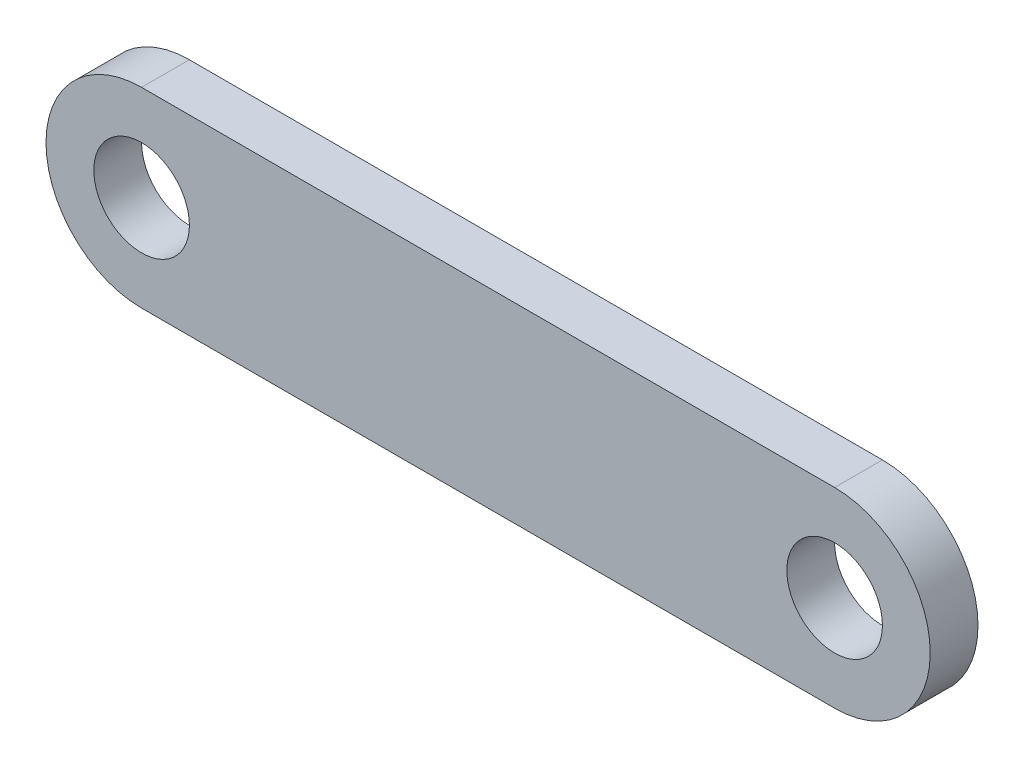
ISO-10303-21;
HEADER;
FILE_DESCRIPTION(('STEP AP214'),'2;1');
FILE_NAME('part.step','',(''),(''),'','','');
FILE_SCHEMA(('AUTOMOTIVE_DESIGN { 1 0 10303 214 1 1 1 1 }'));
ENDSEC;
DATA;
#1=APPLICATION_CONTEXT('core data for automotive mechanical design processes');
#2=APPLICATION_PROTOCOL_DEFINITION('international standard','automotive_design',2000,#1);
#3=PRODUCT_CONTEXT('',#1,'mechanical');
#4=PRODUCT('Part','Part','',(#3));
#5=PRODUCT_RELATED_PRODUCT_CATEGORY('part','',(#4));
#6=PRODUCT_DEFINITION_FORMATION('','',#4);
#7=PRODUCT_DEFINITION_CONTEXT('part definition',#1,'design');
#8=PRODUCT_DEFINITION('design','',#6,#7);
#9=PRODUCT_DEFINITION_SHAPE('','',#8);
#10=(LENGTH_UNIT() NAMED_UNIT(*) SI_UNIT(.MILLI.,.METRE.));
#11=(NAMED_UNIT(*) PLANE_ANGLE_UNIT() SI_UNIT($,.RADIAN.));
#12=(NAMED_UNIT(*) SI_UNIT($,.STERADIAN.) SOLID_ANGLE_UNIT());
#13=UNCERTAINTY_MEASURE_WITH_UNIT(LENGTH_MEASURE(1.E-05),#10,'distance_accuracy_value','');
#14=(GEOMETRIC_REPRESENTATION_CONTEXT(3) GLOBAL_UNCERTAINTY_ASSIGNED_CONTEXT((#13)) GLOBAL_UNIT_ASSIGNED_CONTEXT((#10,
#11,#12)) REPRESENTATION_CONTEXT('',''));
#15=CARTESIAN_POINT('',(0.,0.,0.));
#16=DIRECTION('',(0.,0.,1.));
#17=DIRECTION('',(1.,0.,0.));
#18=AXIS2_PLACEMENT_3D('',#15,#16,#17);
#19=CARTESIAN_POINT('',(0.,0.,2.54));
#20=DIRECTION('',(0.,0.,1.));
#21=DIRECTION('',(1.,0.,0.));
#22=AXIS2_PLACEMENT_3D('',#19,#20,#21);
#23=PLANE('',#22);
#24=CARTESIAN_POINT('',(0.,0.,2.54));
#25=DIRECTION('',(0.,0.,1.));
#26=DIRECTION('',(1.,0.,0.));
#27=AXIS2_PLACEMENT_3D('',#24,#25,#26);
#28=CIRCLE('',#27,2.54);
#29=CARTESIAN_POINT('',(2.54,0.,2.54));
#30=VERTEX_POINT('',#29);
#31=EDGE_CURVE('E101',#30,#30,#28,.T.);
#32=ORIENTED_EDGE('',*,*,#31,.F.);
#33=EDGE_LOOP('',(#32));
#34=FACE_BOUND('',#33,.T.);
#35=CARTESIAN_POINT('',(0.,0.,2.54));
#36=DIRECTION('',(0.,0.,1.));
#37=DIRECTION('',(1.,0.,0.));
#38=AXIS2_PLACEMENT_3D('',#35,#36,#37);
#39=CIRCLE('',#38,5.08);
#40=CARTESIAN_POINT('',(0.,5.08,2.54));
#41=VERTEX_POINT('',#40);
#42=CARTESIAN_POINT('',(0.,-5.08,2.54));
#43=VERTEX_POINT('',#42);
#44=EDGE_CURVE('E86',#41,#43,#39,.T.);
#45=ORIENTED_EDGE('',*,*,#44,.T.);
#46=DIRECTION('',(1.,0.,0.));
#47=VECTOR('',#46,1.);
#48=CARTESIAN_POINT('',(0.,-5.08,2.54));
#49=LINE('',#48,#47);
#50=CARTESIAN_POINT('',(36.83,-5.08,2.54));
#51=VERTEX_POINT('',#50);
#52=EDGE_CURVE('E81',#43,#51,#49,.T.);
#53=ORIENTED_EDGE('',*,*,#52,.T.);
#54=CARTESIAN_POINT('',(36.83,0.,2.54));
#55=DIRECTION('',(0.,0.,1.));
#56=DIRECTION('',(1.,0.,0.));
#57=AXIS2_PLACEMENT_3D('',#54,#55,#56);
#58=CIRCLE('',#57,5.08);
#59=CARTESIAN_POINT('',(36.83,5.08,2.54));
#60=VERTEX_POINT('',#59);
#61=EDGE_CURVE('E84',#51,#60,#58,.T.);
#62=ORIENTED_EDGE('',*,*,#61,.T.);
#63=DIRECTION('',(-1.,0.,0.));
#64=VECTOR('',#63,1.);
#65=CARTESIAN_POINT('',(0.,5.08,2.54));
#66=LINE('',#65,#64);
#67=EDGE_CURVE('E51',#60,#41,#66,.T.);
#68=ORIENTED_EDGE('',*,*,#67,.T.);
#69=EDGE_LOOP('',(#45,#53,#62,#68));
#70=FACE_BOUND('',#69,.T.);
#71=CARTESIAN_POINT('',(36.83,0.,2.54));
#72=DIRECTION('',(0.,0.,1.));
#73=DIRECTION('',(1.,0.,0.));
#74=AXIS2_PLACEMENT_3D('',#71,#72,#73);
#75=CIRCLE('',#74,2.54);
#76=CARTESIAN_POINT('',(39.37,0.,2.54));
#77=VERTEX_POINT('',#76);
#78=EDGE_CURVE('E116',#77,#77,#75,.T.);
#79=ORIENTED_EDGE('',*,*,#78,.F.);
#80=EDGE_LOOP('',(#79));
#81=FACE_BOUND('',#80,.T.);
#82=ADVANCED_FACE('F34',(#34,#70,#81),#23,.T.);
#83=CARTESIAN_POINT('',(0.,0.,0.));
#84=DIRECTION('',(0.,0.,1.));
#85=DIRECTION('',(1.,0.,0.));
#86=AXIS2_PLACEMENT_3D('',#83,#84,#85);
#87=PLANE('',#86);
#88=CARTESIAN_POINT('',(0.,0.,0.));
#89=DIRECTION('',(0.,0.,1.));
#90=DIRECTION('',(1.,0.,0.));
#91=AXIS2_PLACEMENT_3D('',#88,#89,#90);
#92=CIRCLE('',#91,5.08);
#93=CARTESIAN_POINT('',(0.,5.08,0.));
#94=VERTEX_POINT('',#93);
#95=CARTESIAN_POINT('',(0.,-5.08,0.));
#96=VERTEX_POINT('',#95);
#97=EDGE_CURVE('E98',#94,#96,#92,.T.);
#98=ORIENTED_EDGE('',*,*,#97,.F.);
#99=DIRECTION('',(-1.,0.,0.));
#100=VECTOR('',#99,1.);
#101=CARTESIAN_POINT('',(0.,5.08,0.));
#102=LINE('',#101,#100);
#103=CARTESIAN_POINT('',(36.83,5.08,0.));
#104=VERTEX_POINT('',#103);
#105=EDGE_CURVE('E74',#104,#94,#102,.T.);
#106=ORIENTED_EDGE('',*,*,#105,.F.);
#107=CARTESIAN_POINT('',(36.83,0.,0.));
#108=DIRECTION('',(0.,0.,1.));
#109=DIRECTION('',(1.,0.,0.));
#110=AXIS2_PLACEMENT_3D('',#107,#108,#109);
#111=CIRCLE('',#110,5.08);
#112=CARTESIAN_POINT('',(36.83,-5.08,0.));
#113=VERTEX_POINT('',#112);
#114=EDGE_CURVE('E68',#113,#104,#111,.T.);
#115=ORIENTED_EDGE('',*,*,#114,.F.);
#116=DIRECTION('',(1.,0.,0.));
#117=VECTOR('',#116,1.);
#118=CARTESIAN_POINT('',(0.,-5.08,0.));
#119=LINE('',#118,#117);
#120=EDGE_CURVE('E90',#96,#113,#119,.T.);
#121=ORIENTED_EDGE('',*,*,#120,.F.);
#122=EDGE_LOOP('',(#98,#106,#115,#121));
#123=FACE_BOUND('',#122,.T.);
#124=CARTESIAN_POINT('',(0.,0.,0.));
#125=DIRECTION('',(0.,0.,1.));
#126=DIRECTION('',(1.,0.,0.));
#127=AXIS2_PLACEMENT_3D('',#124,#125,#126);
#128=CIRCLE('',#127,2.54);
#129=CARTESIAN_POINT('',(2.54,0.,0.));
#130=VERTEX_POINT('',#129);
#131=EDGE_CURVE('E113',#130,#130,#128,.T.);
#132=ORIENTED_EDGE('',*,*,#131,.T.);
#133=EDGE_LOOP('',(#132));
#134=FACE_BOUND('',#133,.T.);
#135=CARTESIAN_POINT('',(36.83,0.,0.));
#136=DIRECTION('',(0.,0.,1.));
#137=DIRECTION('',(1.,0.,0.));
#138=AXIS2_PLACEMENT_3D('',#135,#136,#137);
#139=CIRCLE('',#138,2.54);
#140=CARTESIAN_POINT('',(39.37,0.,0.));
#141=VERTEX_POINT('',#140);
#142=EDGE_CURVE('E119',#141,#141,#139,.T.);
#143=ORIENTED_EDGE('',*,*,#142,.T.);
#144=EDGE_LOOP('',(#143));
#145=FACE_BOUND('',#144,.T.);
#146=ADVANCED_FACE('F109',(#123,#134,#145),#87,.F.);
#147=CARTESIAN_POINT('',(0.,0.,2.54));
#148=DIRECTION('',(0.,0.,-1.));
#149=DIRECTION('',(-1.,0.,0.));
#150=AXIS2_PLACEMENT_3D('',#147,#148,#149);
#151=CYLINDRICAL_SURFACE('',#150,5.08);
#152=ORIENTED_EDGE('',*,*,#97,.T.);
#153=DIRECTION('',(0.,0.,-1.));
#154=VECTOR('',#153,1.);
#155=CARTESIAN_POINT('',(0.,-5.08,2.54));
#156=LINE('',#155,#154);
#157=EDGE_CURVE('E11',#43,#96,#156,.T.);
#158=ORIENTED_EDGE('',*,*,#157,.F.);
#159=ORIENTED_EDGE('',*,*,#44,.F.);
#160=DIRECTION('',(0.,0.,-1.));
#161=VECTOR('',#160,1.);
#162=CARTESIAN_POINT('',(0.,5.08,2.54));
#163=LINE('',#162,#161);
#164=EDGE_CURVE('E94',#41,#94,#163,.T.);
#165=ORIENTED_EDGE('',*,*,#164,.T.);
#166=EDGE_LOOP('',(#152,#158,#159,#165));
#167=FACE_BOUND('',#166,.T.);
#168=ADVANCED_FACE('F36',(#167),#151,.T.);
#169=CARTESIAN_POINT('',(0.,-5.08,2.54));
#170=DIRECTION('',(0.,1.,0.));
#171=DIRECTION('',(0.,0.,1.));
#172=AXIS2_PLACEMENT_3D('',#169,#170,#171);
#173=PLANE('',#172);
#174=ORIENTED_EDGE('',*,*,#120,.T.);
#175=DIRECTION('',(0.,0.,-1.));
#176=VECTOR('',#175,1.);
#177=CARTESIAN_POINT('',(36.83,-5.08,2.54));
#178=LINE('',#177,#176);
#179=EDGE_CURVE('E43',#51,#113,#178,.T.);
#180=ORIENTED_EDGE('',*,*,#179,.F.);
#181=ORIENTED_EDGE('',*,*,#52,.F.);
#182=ORIENTED_EDGE('',*,*,#157,.T.);
#183=EDGE_LOOP('',(#174,#180,#181,#182));
#184=FACE_BOUND('',#183,.T.);
#185=ADVANCED_FACE('F89',(#184),#173,.F.);
#186=CARTESIAN_POINT('',(36.83,0.,2.54));
#187=DIRECTION('',(0.,0.,-1.));
#188=DIRECTION('',(-1.,0.,0.));
#189=AXIS2_PLACEMENT_3D('',#186,#187,#188);
#190=CYLINDRICAL_SURFACE('',#189,5.08);
#191=ORIENTED_EDGE('',*,*,#114,.T.);
#192=DIRECTION('',(0.,0.,-1.));
#193=VECTOR('',#192,1.);
#194=CARTESIAN_POINT('',(36.83,5.08,2.54));
#195=LINE('',#194,#193);
#196=EDGE_CURVE('E91',#60,#104,#195,.T.);
#197=ORIENTED_EDGE('',*,*,#196,.F.);
#198=ORIENTED_EDGE('',*,*,#61,.F.);
#199=ORIENTED_EDGE('',*,*,#179,.T.);
#200=EDGE_LOOP('',(#191,#197,#198,#199));
#201=FACE_BOUND('',#200,.T.);
#202=ADVANCED_FACE('F92',(#201),#190,.T.);
#203=CARTESIAN_POINT('',(0.,5.08,2.54));
#204=DIRECTION('',(0.,-1.,0.));
#205=DIRECTION('',(0.,0.,-1.));
#206=AXIS2_PLACEMENT_3D('',#203,#204,#205);
#207=PLANE('',#206);
#208=ORIENTED_EDGE('',*,*,#105,.T.);
#209=ORIENTED_EDGE('',*,*,#164,.F.);
#210=ORIENTED_EDGE('',*,*,#67,.F.);
#211=ORIENTED_EDGE('',*,*,#196,.T.);
#212=EDGE_LOOP('',(#208,#209,#210,#211));
#213=FACE_BOUND('',#212,.T.);
#214=ADVANCED_FACE('F106',(#213),#207,.F.);
#215=CARTESIAN_POINT('',(0.,0.,2.54));
#216=DIRECTION('',(0.,0.,-1.));
#217=DIRECTION('',(-1.,0.,0.));
#218=AXIS2_PLACEMENT_3D('',#215,#216,#217);
#219=CYLINDRICAL_SURFACE('',#218,2.54);
#220=ORIENTED_EDGE('',*,*,#31,.T.);
#221=EDGE_LOOP('',(#220));
#222=FACE_BOUND('',#221,.T.);
#223=ORIENTED_EDGE('',*,*,#131,.F.);
#224=EDGE_LOOP('',(#223));
#225=FACE_BOUND('',#224,.T.);
#226=ADVANCED_FACE('F136',(#222,#225),#219,.F.);
#227=CARTESIAN_POINT('',(36.83,0.,2.54));
#228=DIRECTION('',(0.,0.,-1.));
#229=DIRECTION('',(-1.,0.,0.));
#230=AXIS2_PLACEMENT_3D('',#227,#228,#229);
#231=CYLINDRICAL_SURFACE('',#230,2.54);
#232=ORIENTED_EDGE('',*,*,#78,.T.);
#233=EDGE_LOOP('',(#232));
#234=FACE_BOUND('',#233,.T.);
#235=ORIENTED_EDGE('',*,*,#142,.F.);
#236=EDGE_LOOP('',(#235));
#237=FACE_BOUND('',#236,.T.);
#238=ADVANCED_FACE('F125',(#234,#237),#231,.F.);
#239=CLOSED_SHELL('',(#82,#146,#168,#185,#202,#214,#226,#238));
#240=MANIFOLD_SOLID_BREP('B2',#239);
#241=ADVANCED_BREP_SHAPE_REPRESENTATION('',(#18,#240),#14);
#242=SHAPE_DEFINITION_REPRESENTATION(#9,#241);
ENDSEC;
END-ISO-10303-21;
